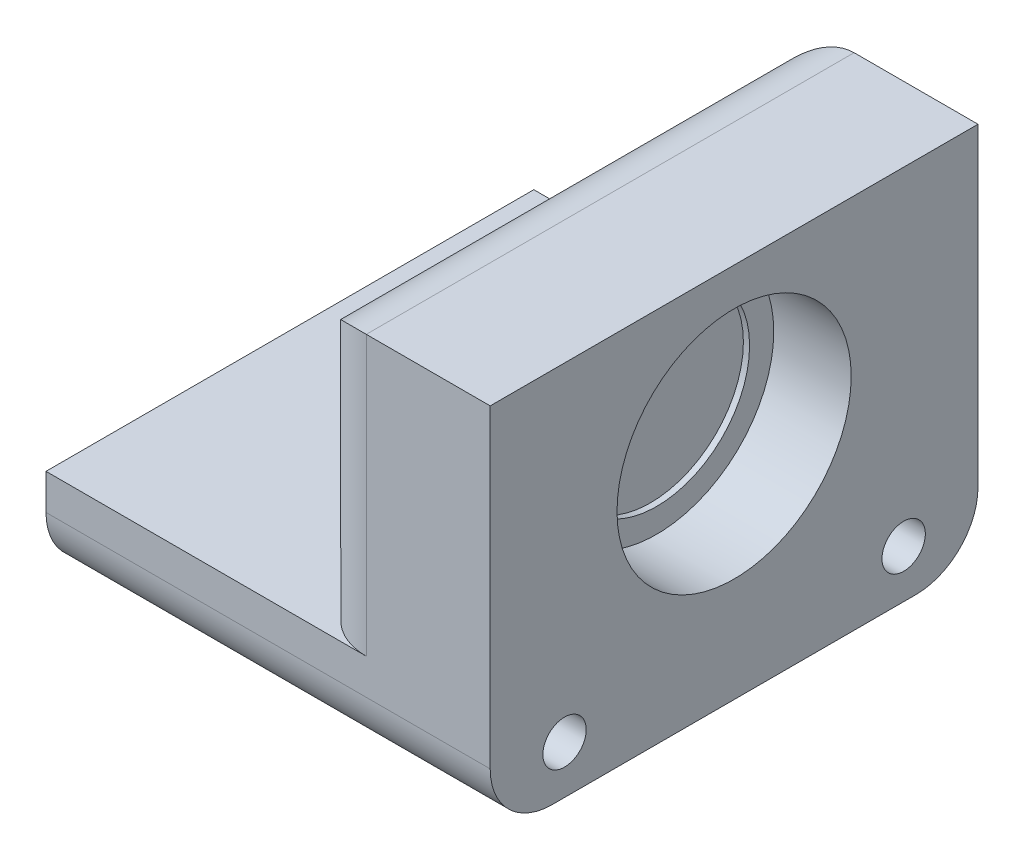
ISO-10303-21;
HEADER;
FILE_DESCRIPTION(('STEP AP214'),'2;1');
FILE_NAME('part.step','',(''),(''),'','','');
FILE_SCHEMA(('AUTOMOTIVE_DESIGN { 1 0 10303 214 1 1 1 1 }'));
ENDSEC;
DATA;
#1=APPLICATION_CONTEXT('core data for automotive mechanical design processes');
#2=APPLICATION_PROTOCOL_DEFINITION('international standard','automotive_design',2000,#1);
#3=PRODUCT_CONTEXT('',#1,'mechanical');
#4=PRODUCT('Part','Part','',(#3));
#5=PRODUCT_RELATED_PRODUCT_CATEGORY('part','',(#4));
#6=PRODUCT_DEFINITION_FORMATION('','',#4);
#7=PRODUCT_DEFINITION_CONTEXT('part definition',#1,'design');
#8=PRODUCT_DEFINITION('design','',#6,#7);
#9=PRODUCT_DEFINITION_SHAPE('','',#8);
#10=(LENGTH_UNIT() NAMED_UNIT(*) SI_UNIT(.MILLI.,.METRE.));
#11=(NAMED_UNIT(*) PLANE_ANGLE_UNIT() SI_UNIT($,.RADIAN.));
#12=(NAMED_UNIT(*) SI_UNIT($,.STERADIAN.) SOLID_ANGLE_UNIT());
#13=UNCERTAINTY_MEASURE_WITH_UNIT(LENGTH_MEASURE(1.E-05),#10,'distance_accuracy_value','');
#14=(GEOMETRIC_REPRESENTATION_CONTEXT(3) GLOBAL_UNCERTAINTY_ASSIGNED_CONTEXT((#13)) GLOBAL_UNIT_ASSIGNED_CONTEXT((#10,
#11,#12)) REPRESENTATION_CONTEXT('',''));
#15=CARTESIAN_POINT('',(0.,0.,0.));
#16=DIRECTION('',(0.,0.,1.));
#17=DIRECTION('',(1.,0.,0.));
#18=AXIS2_PLACEMENT_3D('',#15,#16,#17);
#19=CARTESIAN_POINT('',(-61.1504901312249,0.,-20.));
#20=DIRECTION('',(0.,1.,0.));
#21=DIRECTION('',(-1.,0.,0.));
#22=AXIS2_PLACEMENT_3D('',#19,#20,#21);
#23=PLANE('',#22);
#24=CARTESIAN_POINT('',(-64.492285063225,0.,-12.750000088));
#25=DIRECTION('',(0.,1.,0.));
#26=DIRECTION('',(-1.,0.,0.));
#27=AXIS2_PLACEMENT_3D('',#24,#25,#26);
#28=CIRCLE('',#27,1.26349999999999);
#29=CARTESIAN_POINT('',(-65.755785063225,0.,-12.750000088));
#30=VERTEX_POINT('',#29);
#31=EDGE_CURVE('E365',#30,#30,#28,.T.);
#32=ORIENTED_EDGE('',*,*,#31,.F.);
#33=EDGE_LOOP('',(#32));
#34=FACE_BOUND('',#33,.T.);
#35=CARTESIAN_POINT('',(-64.492285063225,0.,-7.249999912));
#36=DIRECTION('',(0.,1.,0.));
#37=DIRECTION('',(-1.,0.,0.));
#38=AXIS2_PLACEMENT_3D('',#35,#36,#37);
#39=CIRCLE('',#38,1.26349999999999);
#40=CARTESIAN_POINT('',(-65.755785063225,0.,-7.249999912));
#41=VERTEX_POINT('',#40);
#42=EDGE_CURVE('E261',#41,#41,#39,.T.);
#43=ORIENTED_EDGE('',*,*,#42,.F.);
#44=EDGE_LOOP('',(#43));
#45=FACE_BOUND('',#44,.T.);
#46=DIRECTION('',(-1.,0.,0.));
#47=VECTOR('',#46,1.);
#48=CARTESIAN_POINT('',(-61.1504901312249,0.,0.));
#49=LINE('',#48,#47);
#50=CARTESIAN_POINT('',(-58.6104901312249,0.,0.));
#51=VERTEX_POINT('',#50);
#52=CARTESIAN_POINT('',(-71.742285041225,0.,0.));
#53=VERTEX_POINT('',#52);
#54=EDGE_CURVE('E152',#51,#53,#49,.T.);
#55=ORIENTED_EDGE('',*,*,#54,.F.);
#56=CARTESIAN_POINT('',(-58.6104901312249,0.,-2.54));
#57=DIRECTION('',(0.,1.,0.));
#58=DIRECTION('',(-1.,0.,0.));
#59=AXIS2_PLACEMENT_3D('',#56,#57,#58);
#60=CIRCLE('',#59,2.54);
#61=CARTESIAN_POINT('',(-61.1504901312249,0.,-2.54));
#62=VERTEX_POINT('',#61);
#63=EDGE_CURVE('E11',#51,#62,#60,.F.);
#64=ORIENTED_EDGE('',*,*,#63,.T.);
#65=DIRECTION('',(0.,0.,1.));
#66=VECTOR('',#65,1.);
#67=CARTESIAN_POINT('',(-61.1504901312249,0.,-20.));
#68=LINE('',#67,#66);
#69=CARTESIAN_POINT('',(-61.1504901312249,0.,-17.46));
#70=VERTEX_POINT('',#69);
#71=EDGE_CURVE('E157',#70,#62,#68,.T.);
#72=ORIENTED_EDGE('',*,*,#71,.F.);
#73=CARTESIAN_POINT('',(-58.6104901312249,0.,-17.46));
#74=DIRECTION('',(0.,1.,0.));
#75=DIRECTION('',(-1.,0.,0.));
#76=AXIS2_PLACEMENT_3D('',#73,#74,#75);
#77=CIRCLE('',#76,2.54);
#78=CARTESIAN_POINT('',(-58.6104901312249,0.,-20.));
#79=VERTEX_POINT('',#78);
#80=EDGE_CURVE('E42',#70,#79,#77,.F.);
#81=ORIENTED_EDGE('',*,*,#80,.T.);
#82=DIRECTION('',(-1.,0.,0.));
#83=VECTOR('',#82,1.);
#84=CARTESIAN_POINT('',(-61.1504901312249,0.,-20.));
#85=LINE('',#84,#83);
#86=CARTESIAN_POINT('',(-71.742285041225,0.,-20.));
#87=VERTEX_POINT('',#86);
#88=EDGE_CURVE('E131',#79,#87,#85,.T.);
#89=ORIENTED_EDGE('',*,*,#88,.T.);
#90=DIRECTION('',(0.,0.,1.));
#91=VECTOR('',#90,1.);
#92=CARTESIAN_POINT('',(-71.742285041225,0.,-20.));
#93=LINE('',#92,#91);
#94=EDGE_CURVE('E117',#87,#53,#93,.T.);
#95=ORIENTED_EDGE('',*,*,#94,.T.);
#96=EDGE_LOOP('',(#55,#64,#72,#81,#89,#95));
#97=FACE_BOUND('',#96,.T.);
#98=ADVANCED_FACE('F33',(#34,#45,#97),#23,.T.);
#99=CARTESIAN_POINT('',(-61.1504901312249,11.43,-20.));
#100=DIRECTION('',(-1.,0.,0.));
#101=DIRECTION('',(0.,0.,1.));
#102=AXIS2_PLACEMENT_3D('',#99,#100,#101);
#103=PLANE('',#102);
#104=DIRECTION('',(0.,0.,1.));
#105=VECTOR('',#104,1.);
#106=CARTESIAN_POINT('',(-61.1504901312249,8.88999999999999,-20.));
#107=LINE('',#106,#105);
#108=CARTESIAN_POINT('',(-61.1504901312249,8.88999999999999,-12.9205582274627));
#109=VERTEX_POINT('',#108);
#110=CARTESIAN_POINT('',(-61.1504901312249,8.88999999999999,-17.46));
#111=VERTEX_POINT('',#110);
#112=EDGE_CURVE('E170',#109,#111,#107,.F.);
#113=ORIENTED_EDGE('',*,*,#112,.T.);
#114=DIRECTION('',(0.,-1.,0.));
#115=VECTOR('',#114,1.);
#116=CARTESIAN_POINT('',(-61.1504901312249,0.,-17.46));
#117=LINE('',#116,#115);
#118=EDGE_CURVE('E172',#111,#70,#117,.T.);
#119=ORIENTED_EDGE('',*,*,#118,.T.);
#120=ORIENTED_EDGE('',*,*,#71,.T.);
#121=DIRECTION('',(0.,-1.,0.));
#122=VECTOR('',#121,1.);
#123=CARTESIAN_POINT('',(-61.1504901312249,11.43,-2.54));
#124=LINE('',#123,#122);
#125=CARTESIAN_POINT('',(-61.1504901312249,8.88999999999999,-2.54));
#126=VERTEX_POINT('',#125);
#127=EDGE_CURVE('E160',#62,#126,#124,.F.);
#128=ORIENTED_EDGE('',*,*,#127,.T.);
#129=DIRECTION('',(0.,0.,1.));
#130=VECTOR('',#129,1.);
#131=CARTESIAN_POINT('',(-61.1504901312249,8.88999999999999,-20.));
#132=LINE('',#131,#130);
#133=CARTESIAN_POINT('',(-61.1504901312249,8.88999999999999,-7.07944177253729));
#134=VERTEX_POINT('',#133);
#135=EDGE_CURVE('E168',#126,#134,#132,.F.);
#136=ORIENTED_EDGE('',*,*,#135,.T.);
#137=CARTESIAN_POINT('',(-61.1504901312249,5.08,-10.));
#138=DIRECTION('',(-1.,0.,0.));
#139=DIRECTION('',(0.,0.,1.));
#140=AXIS2_PLACEMENT_3D('',#137,#138,#139);
#141=CIRCLE('',#140,4.8006);
#142=EDGE_CURVE('E299',#109,#134,#141,.T.);
#143=ORIENTED_EDGE('',*,*,#142,.F.);
#144=EDGE_LOOP('',(#113,#119,#120,#128,#136,#143));
#145=FACE_BOUND('',#144,.T.);
#146=ADVANCED_FACE('F223',(#145),#103,.T.);
#147=CARTESIAN_POINT('',(-53.530479711225,11.43,-20.));
#148=DIRECTION('',(0.,1.,0.));
#149=DIRECTION('',(0.,0.,1.));
#150=AXIS2_PLACEMENT_3D('',#147,#148,#149);
#151=PLANE('',#150);
#152=DIRECTION('',(-1.,0.,0.));
#153=VECTOR('',#152,1.);
#154=CARTESIAN_POINT('',(-53.530479711225,11.43,-20.));
#155=LINE('',#154,#153);
#156=CARTESIAN_POINT('',(-53.530479711225,11.43,-20.));
#157=VERTEX_POINT('',#156);
#158=CARTESIAN_POINT('',(-58.6104901312249,11.43,-20.));
#159=VERTEX_POINT('',#158);
#160=EDGE_CURVE('E127',#157,#159,#155,.T.);
#161=ORIENTED_EDGE('',*,*,#160,.T.);
#162=DIRECTION('',(0.,0.,1.));
#163=VECTOR('',#162,1.);
#164=CARTESIAN_POINT('',(-58.6104901312249,11.43,-20.));
#165=LINE('',#164,#163);
#166=CARTESIAN_POINT('',(-58.6104901312249,11.43,0.));
#167=VERTEX_POINT('',#166);
#168=EDGE_CURVE('E178',#159,#167,#165,.T.);
#169=ORIENTED_EDGE('',*,*,#168,.T.);
#170=DIRECTION('',(-1.,0.,0.));
#171=VECTOR('',#170,1.);
#172=CARTESIAN_POINT('',(-53.530479711225,11.43,0.));
#173=LINE('',#172,#171);
#174=CARTESIAN_POINT('',(-53.530479711225,11.43,0.));
#175=VERTEX_POINT('',#174);
#176=EDGE_CURVE('E140',#175,#167,#173,.T.);
#177=ORIENTED_EDGE('',*,*,#176,.F.);
#178=DIRECTION('',(0.,0.,1.));
#179=VECTOR('',#178,1.);
#180=CARTESIAN_POINT('',(-53.530479711225,11.43,-20.));
#181=LINE('',#180,#179);
#182=EDGE_CURVE('E161',#157,#175,#181,.T.);
#183=ORIENTED_EDGE('',*,*,#182,.F.);
#184=EDGE_LOOP('',(#161,#169,#177,#183));
#185=FACE_BOUND('',#184,.T.);
#186=ADVANCED_FACE('F226',(#185),#151,.T.);
#187=CARTESIAN_POINT('',(-53.530479711225,-4.00000000000001,-20.));
#188=DIRECTION('',(1.,0.,0.));
#189=DIRECTION('',(0.,0.,-1.));
#190=AXIS2_PLACEMENT_3D('',#187,#188,#189);
#191=PLANE('',#190);
#192=CARTESIAN_POINT('',(-53.530479711225,-2.03200000000001,-16.952));
#193=DIRECTION('',(-1.,0.,0.));
#194=DIRECTION('',(0.,0.,1.));
#195=AXIS2_PLACEMENT_3D('',#192,#193,#194);
#196=CIRCLE('',#195,0.888999999999995);
#197=CARTESIAN_POINT('',(-53.530479711225,-2.03200000000001,-16.063));
#198=VERTEX_POINT('',#197);
#199=EDGE_CURVE('E352',#198,#198,#196,.T.);
#200=ORIENTED_EDGE('',*,*,#199,.T.);
#201=EDGE_LOOP('',(#200));
#202=FACE_BOUND('',#201,.T.);
#203=CARTESIAN_POINT('',(-53.530479711225,-2.03200000000001,-3.048));
#204=DIRECTION('',(-1.,0.,0.));
#205=DIRECTION('',(0.,0.,1.));
#206=AXIS2_PLACEMENT_3D('',#203,#204,#205);
#207=CIRCLE('',#206,0.888999999999995);
#208=CARTESIAN_POINT('',(-53.530479711225,-2.03200000000001,-2.159));
#209=VERTEX_POINT('',#208);
#210=EDGE_CURVE('E338',#209,#209,#207,.T.);
#211=ORIENTED_EDGE('',*,*,#210,.T.);
#212=EDGE_LOOP('',(#211));
#213=FACE_BOUND('',#212,.T.);
#214=CARTESIAN_POINT('',(-53.530479711225,5.08,-10.));
#215=DIRECTION('',(1.,0.,0.));
#216=DIRECTION('',(0.,0.,-1.));
#217=AXIS2_PLACEMENT_3D('',#214,#215,#216);
#218=CIRCLE('',#217,4.8006);
#219=CARTESIAN_POINT('',(-53.530479711225,5.08,-14.8006));
#220=VERTEX_POINT('',#219);
#221=EDGE_CURVE('E329',#220,#220,#218,.T.);
#222=ORIENTED_EDGE('',*,*,#221,.F.);
#223=EDGE_LOOP('',(#222));
#224=FACE_BOUND('',#223,.T.);
#225=DIRECTION('',(0.,1.,0.));
#226=VECTOR('',#225,1.);
#227=CARTESIAN_POINT('',(-53.530479711225,-4.00000000000001,0.));
#228=LINE('',#227,#226);
#229=CARTESIAN_POINT('',(-53.530479711225,-1.46000000000001,0.));
#230=VERTEX_POINT('',#229);
#231=EDGE_CURVE('E143',#230,#175,#228,.T.);
#232=ORIENTED_EDGE('',*,*,#231,.F.);
#233=CARTESIAN_POINT('',(-53.530479711225,-1.46000000000001,-2.54));
#234=DIRECTION('',(1.,0.,0.));
#235=DIRECTION('',(0.,0.,-1.));
#236=AXIS2_PLACEMENT_3D('',#233,#234,#235);
#237=CIRCLE('',#236,2.54);
#238=CARTESIAN_POINT('',(-53.530479711225,-4.00000000000001,-2.54));
#239=VERTEX_POINT('',#238);
#240=EDGE_CURVE('E276',#230,#239,#237,.T.);
#241=ORIENTED_EDGE('',*,*,#240,.T.);
#242=DIRECTION('',(0.,0.,1.));
#243=VECTOR('',#242,1.);
#244=CARTESIAN_POINT('',(-53.530479711225,-4.00000000000001,-20.));
#245=LINE('',#244,#243);
#246=CARTESIAN_POINT('',(-53.530479711225,-4.00000000000001,-17.46));
#247=VERTEX_POINT('',#246);
#248=EDGE_CURVE('E164',#247,#239,#245,.T.);
#249=ORIENTED_EDGE('',*,*,#248,.F.);
#250=CARTESIAN_POINT('',(-53.530479711225,-1.46000000000001,-17.46));
#251=DIRECTION('',(1.,0.,0.));
#252=DIRECTION('',(0.,0.,-1.));
#253=AXIS2_PLACEMENT_3D('',#250,#251,#252);
#254=CIRCLE('',#253,2.54);
#255=CARTESIAN_POINT('',(-53.530479711225,-1.46000000000001,-20.));
#256=VERTEX_POINT('',#255);
#257=EDGE_CURVE('E278',#247,#256,#254,.T.);
#258=ORIENTED_EDGE('',*,*,#257,.T.);
#259=DIRECTION('',(0.,1.,0.));
#260=VECTOR('',#259,1.);
#261=CARTESIAN_POINT('',(-53.530479711225,-4.00000000000001,-20.));
#262=LINE('',#261,#260);
#263=EDGE_CURVE('E136',#256,#157,#262,.T.);
#264=ORIENTED_EDGE('',*,*,#263,.T.);
#265=ORIENTED_EDGE('',*,*,#182,.T.);
#266=EDGE_LOOP('',(#232,#241,#249,#258,#264,#265));
#267=FACE_BOUND('',#266,.T.);
#268=ADVANCED_FACE('F230',(#202,#213,#224,#267),#191,.T.);
#269=CARTESIAN_POINT('',(-71.742285041225,-4.00000000000001,-20.));
#270=DIRECTION('',(0.,-1.,0.));
#271=DIRECTION('',(1.,0.,0.));
#272=AXIS2_PLACEMENT_3D('',#269,#270,#271);
#273=PLANE('',#272);
#274=CARTESIAN_POINT('',(-64.492285063225,-4.00000000000001,-12.750000088));
#275=DIRECTION('',(0.,-1.,0.));
#276=DIRECTION('',(-1.,0.,0.));
#277=AXIS2_PLACEMENT_3D('',#274,#275,#276);
#278=CIRCLE('',#277,1.26349999999999);
#279=CARTESIAN_POINT('',(-65.755785063225,-4.00000000000001,-12.750000088));
#280=VERTEX_POINT('',#279);
#281=EDGE_CURVE('E368',#280,#280,#278,.T.);
#282=ORIENTED_EDGE('',*,*,#281,.F.);
#283=EDGE_LOOP('',(#282));
#284=FACE_BOUND('',#283,.T.);
#285=CARTESIAN_POINT('',(-64.492285063225,-4.00000000000001,-7.249999912));
#286=DIRECTION('',(0.,-1.,0.));
#287=DIRECTION('',(1.,0.,0.));
#288=AXIS2_PLACEMENT_3D('',#285,#286,#287);
#289=CIRCLE('',#288,1.26349999999999);
#290=CARTESIAN_POINT('',(-63.228785063225,-4.00000000000001,-7.249999912));
#291=VERTEX_POINT('',#290);
#292=EDGE_CURVE('E265',#291,#291,#289,.T.);
#293=ORIENTED_EDGE('',*,*,#292,.F.);
#294=EDGE_LOOP('',(#293));
#295=FACE_BOUND('',#294,.T.);
#296=ORIENTED_EDGE('',*,*,#248,.T.);
#297=DIRECTION('',(1.,0.,0.));
#298=VECTOR('',#297,1.);
#299=CARTESIAN_POINT('',(-71.742285041225,-4.00000000000001,-2.54));
#300=LINE('',#299,#298);
#301=CARTESIAN_POINT('',(-71.742285041225,-4.00000000000001,-2.54));
#302=VERTEX_POINT('',#301);
#303=EDGE_CURVE('E50',#239,#302,#300,.F.);
#304=ORIENTED_EDGE('',*,*,#303,.T.);
#305=DIRECTION('',(0.,0.,1.));
#306=VECTOR('',#305,1.);
#307=CARTESIAN_POINT('',(-71.742285041225,-4.00000000000001,-20.));
#308=LINE('',#307,#306);
#309=CARTESIAN_POINT('',(-71.742285041225,-4.00000000000001,-17.46));
#310=VERTEX_POINT('',#309);
#311=EDGE_CURVE('E126',#310,#302,#308,.T.);
#312=ORIENTED_EDGE('',*,*,#311,.F.);
#313=DIRECTION('',(1.,0.,0.));
#314=VECTOR('',#313,1.);
#315=CARTESIAN_POINT('',(-53.530479711225,-4.00000000000001,-17.46));
#316=LINE('',#315,#314);
#317=EDGE_CURVE('E273',#310,#247,#316,.T.);
#318=ORIENTED_EDGE('',*,*,#317,.T.);
#319=EDGE_LOOP('',(#296,#304,#312,#318));
#320=FACE_BOUND('',#319,.T.);
#321=ADVANCED_FACE('F234',(#284,#295,#320),#273,.T.);
#322=CARTESIAN_POINT('',(-71.742285041225,0.,-20.));
#323=DIRECTION('',(-1.,0.,0.));
#324=DIRECTION('',(0.,0.,1.));
#325=AXIS2_PLACEMENT_3D('',#322,#323,#324);
#326=PLANE('',#325);
#327=CARTESIAN_POINT('',(-71.742285041225,-2.03200000000001,-16.952));
#328=DIRECTION('',(-1.,0.,0.));
#329=DIRECTION('',(0.,0.,1.));
#330=AXIS2_PLACEMENT_3D('',#327,#328,#329);
#331=CIRCLE('',#330,1.5875);
#332=CARTESIAN_POINT('',(-71.742285041225,-2.03200000000001,-15.3645));
#333=VERTEX_POINT('',#332);
#334=EDGE_CURVE('E263',#333,#333,#331,.T.);
#335=ORIENTED_EDGE('',*,*,#334,.F.);
#336=EDGE_LOOP('',(#335));
#337=FACE_BOUND('',#336,.T.);
#338=CARTESIAN_POINT('',(-71.742285041225,-2.03200000000001,-3.048));
#339=DIRECTION('',(-1.,0.,0.));
#340=DIRECTION('',(0.,0.,1.));
#341=AXIS2_PLACEMENT_3D('',#338,#339,#340);
#342=CIRCLE('',#341,1.5875);
#343=CARTESIAN_POINT('',(-71.742285041225,-2.03200000000001,-1.4605));
#344=VERTEX_POINT('',#343);
#345=EDGE_CURVE('E349',#344,#344,#342,.T.);
#346=ORIENTED_EDGE('',*,*,#345,.F.);
#347=EDGE_LOOP('',(#346));
#348=FACE_BOUND('',#347,.T.);
#349=CARTESIAN_POINT('',(-71.742285041225,-2.00000000000001,-7.714));
#350=DIRECTION('',(-1.,0.,0.));
#351=DIRECTION('',(0.,0.,-1.));
#352=AXIS2_PLACEMENT_3D('',#349,#350,#351);
#353=CIRCLE('',#352,1.27);
#354=CARTESIAN_POINT('',(-71.742285041225,-2.00000000000001,-8.984));
#355=VERTEX_POINT('',#354);
#356=EDGE_CURVE('E305',#355,#355,#353,.T.);
#357=ORIENTED_EDGE('',*,*,#356,.F.);
#358=EDGE_LOOP('',(#357));
#359=FACE_BOUND('',#358,.T.);
#360=CARTESIAN_POINT('',(-71.742285041225,-2.00000000000001,-12.286));
#361=DIRECTION('',(-1.,0.,0.));
#362=DIRECTION('',(0.,0.,1.));
#363=AXIS2_PLACEMENT_3D('',#360,#361,#362);
#364=CIRCLE('',#363,1.27);
#365=CARTESIAN_POINT('',(-71.742285041225,-2.00000000000001,-11.016));
#366=VERTEX_POINT('',#365);
#367=EDGE_CURVE('E146',#366,#366,#364,.T.);
#368=ORIENTED_EDGE('',*,*,#367,.F.);
#369=EDGE_LOOP('',(#368));
#370=FACE_BOUND('',#369,.T.);
#371=ORIENTED_EDGE('',*,*,#311,.T.);
#372=CARTESIAN_POINT('',(-71.742285041225,-1.46000000000001,-2.54));
#373=DIRECTION('',(-1.,0.,0.));
#374=DIRECTION('',(0.,0.,1.));
#375=AXIS2_PLACEMENT_3D('',#372,#373,#374);
#376=CIRCLE('',#375,2.54);
#377=CARTESIAN_POINT('',(-71.742285041225,-1.46000000000001,0.));
#378=VERTEX_POINT('',#377);
#379=EDGE_CURVE('E269',#302,#378,#376,.T.);
#380=ORIENTED_EDGE('',*,*,#379,.T.);
#381=DIRECTION('',(0.,-1.,0.));
#382=VECTOR('',#381,1.);
#383=CARTESIAN_POINT('',(-71.742285041225,0.,0.));
#384=LINE('',#383,#382);
#385=EDGE_CURVE('E122',#53,#378,#384,.T.);
#386=ORIENTED_EDGE('',*,*,#385,.F.);
#387=ORIENTED_EDGE('',*,*,#94,.F.);
#388=DIRECTION('',(0.,-1.,0.));
#389=VECTOR('',#388,1.);
#390=CARTESIAN_POINT('',(-71.742285041225,0.,-20.));
#391=LINE('',#390,#389);
#392=CARTESIAN_POINT('',(-71.742285041225,-1.46000000000001,-20.));
#393=VERTEX_POINT('',#392);
#394=EDGE_CURVE('E120',#87,#393,#391,.T.);
#395=ORIENTED_EDGE('',*,*,#394,.T.);
#396=CARTESIAN_POINT('',(-71.742285041225,-1.46000000000001,-17.46));
#397=DIRECTION('',(-1.,0.,0.));
#398=DIRECTION('',(0.,0.,1.));
#399=AXIS2_PLACEMENT_3D('',#396,#397,#398);
#400=CIRCLE('',#399,2.54);
#401=EDGE_CURVE('E57',#393,#310,#400,.T.);
#402=ORIENTED_EDGE('',*,*,#401,.T.);
#403=EDGE_LOOP('',(#371,#380,#386,#387,#395,#402));
#404=FACE_BOUND('',#403,.T.);
#405=ADVANCED_FACE('F119',(#337,#348,#359,#370,#404),#326,.T.);
#406=CARTESIAN_POINT('',(0.,0.,-20.));
#407=DIRECTION('',(0.,0.,1.));
#408=DIRECTION('',(1.,0.,0.));
#409=AXIS2_PLACEMENT_3D('',#406,#407,#408);
#410=PLANE('',#409);
#411=ORIENTED_EDGE('',*,*,#88,.F.);
#412=DIRECTION('',(0.,-1.,0.));
#413=VECTOR('',#412,1.);
#414=CARTESIAN_POINT('',(-58.6104901312249,11.43,-20.));
#415=LINE('',#414,#413);
#416=EDGE_CURVE('E176',#79,#159,#415,.F.);
#417=ORIENTED_EDGE('',*,*,#416,.T.);
#418=ORIENTED_EDGE('',*,*,#160,.F.);
#419=ORIENTED_EDGE('',*,*,#263,.F.);
#420=DIRECTION('',(1.,0.,0.));
#421=VECTOR('',#420,1.);
#422=CARTESIAN_POINT('',(-71.742285041225,-1.46000000000001,-20.));
#423=LINE('',#422,#421);
#424=EDGE_CURVE('E135',#256,#393,#423,.F.);
#425=ORIENTED_EDGE('',*,*,#424,.T.);
#426=ORIENTED_EDGE('',*,*,#394,.F.);
#427=EDGE_LOOP('',(#411,#417,#418,#419,#425,#426));
#428=FACE_BOUND('',#427,.T.);
#429=ADVANCED_FACE('F130',(#428),#410,.F.);
#430=CARTESIAN_POINT('',(0.,0.,0.));
#431=DIRECTION('',(0.,0.,1.));
#432=DIRECTION('',(1.,0.,0.));
#433=AXIS2_PLACEMENT_3D('',#430,#431,#432);
#434=PLANE('',#433);
#435=ORIENTED_EDGE('',*,*,#176,.T.);
#436=DIRECTION('',(0.,-1.,0.));
#437=VECTOR('',#436,1.);
#438=CARTESIAN_POINT('',(-58.6104901312249,0.,0.));
#439=LINE('',#438,#437);
#440=EDGE_CURVE('E279',#167,#51,#439,.T.);
#441=ORIENTED_EDGE('',*,*,#440,.T.);
#442=ORIENTED_EDGE('',*,*,#54,.T.);
#443=ORIENTED_EDGE('',*,*,#385,.T.);
#444=DIRECTION('',(1.,0.,0.));
#445=VECTOR('',#444,1.);
#446=CARTESIAN_POINT('',(0.,-1.46000000000001,0.));
#447=LINE('',#446,#445);
#448=EDGE_CURVE('E187',#378,#230,#447,.T.);
#449=ORIENTED_EDGE('',*,*,#448,.T.);
#450=ORIENTED_EDGE('',*,*,#231,.T.);
#451=EDGE_LOOP('',(#435,#441,#442,#443,#449,#450));
#452=FACE_BOUND('',#451,.T.);
#453=ADVANCED_FACE('F216',(#452),#434,.T.);
#454=CARTESIAN_POINT('',(-67.7422849132249,-2.00000000000001,-12.286));
#455=DIRECTION('',(-1.,0.,0.));
#456=DIRECTION('',(0.,0.,1.));
#457=AXIS2_PLACEMENT_3D('',#454,#455,#456);
#458=CYLINDRICAL_SURFACE('',#457,1.27);
#459=CARTESIAN_POINT('',(-67.7422849132249,-2.00000000000001,-12.286));
#460=DIRECTION('',(-1.,0.,0.));
#461=DIRECTION('',(0.,0.,1.));
#462=AXIS2_PLACEMENT_3D('',#459,#460,#461);
#463=CIRCLE('',#462,1.27);
#464=CARTESIAN_POINT('',(-67.7422849132249,-2.00000000000001,-11.016));
#465=VERTEX_POINT('',#464);
#466=EDGE_CURVE('E154',#465,#465,#463,.T.);
#467=ORIENTED_EDGE('',*,*,#466,.F.);
#468=EDGE_LOOP('',(#467));
#469=FACE_BOUND('',#468,.T.);
#470=ORIENTED_EDGE('',*,*,#367,.T.);
#471=EDGE_LOOP('',(#470));
#472=FACE_BOUND('',#471,.T.);
#473=ADVANCED_FACE('F212',(#469,#472),#458,.F.);
#474=CARTESIAN_POINT('',(-67.7422849132249,-2.00000000000001,-12.286));
#475=DIRECTION('',(-1.,0.,0.));
#476=DIRECTION('',(0.,0.,1.));
#477=AXIS2_PLACEMENT_3D('',#474,#475,#476);
#478=PLANE('',#477);
#479=ORIENTED_EDGE('',*,*,#466,.T.);
#480=EDGE_LOOP('',(#479));
#481=FACE_BOUND('',#480,.T.);
#482=ADVANCED_FACE('F208',(#481),#478,.T.);
#483=CARTESIAN_POINT('',(-67.7422849132249,-2.00000000000001,-7.714));
#484=DIRECTION('',(-1.,0.,0.));
#485=DIRECTION('',(0.,0.,1.));
#486=AXIS2_PLACEMENT_3D('',#483,#484,#485);
#487=CYLINDRICAL_SURFACE('',#486,1.27);
#488=CARTESIAN_POINT('',(-67.7422849132249,-2.00000000000001,-7.714));
#489=DIRECTION('',(-1.,0.,0.));
#490=DIRECTION('',(0.,0.,-1.));
#491=AXIS2_PLACEMENT_3D('',#488,#489,#490);
#492=CIRCLE('',#491,1.27);
#493=CARTESIAN_POINT('',(-67.7422849132249,-2.00000000000001,-8.984));
#494=VERTEX_POINT('',#493);
#495=EDGE_CURVE('E312',#494,#494,#492,.T.);
#496=ORIENTED_EDGE('',*,*,#495,.F.);
#497=EDGE_LOOP('',(#496));
#498=FACE_BOUND('',#497,.T.);
#499=ORIENTED_EDGE('',*,*,#356,.T.);
#500=EDGE_LOOP('',(#499));
#501=FACE_BOUND('',#500,.T.);
#502=ADVANCED_FACE('F204',(#498,#501),#487,.F.);
#503=CARTESIAN_POINT('',(-67.7422849132249,-2.00000000000001,-7.714));
#504=DIRECTION('',(1.,0.,0.));
#505=DIRECTION('',(0.,0.,-1.));
#506=AXIS2_PLACEMENT_3D('',#503,#504,#505);
#507=PLANE('',#506);
#508=ORIENTED_EDGE('',*,*,#495,.T.);
#509=EDGE_LOOP('',(#508));
#510=FACE_BOUND('',#509,.T.);
#511=ADVANCED_FACE('F199',(#510),#507,.F.);
#512=CARTESIAN_POINT('',(-57.975490131225,5.08,-10.));
#513=DIRECTION('',(-1.,0.,0.));
#514=DIRECTION('',(0.,0.,1.));
#515=AXIS2_PLACEMENT_3D('',#512,#513,#514);
#516=CYLINDRICAL_SURFACE('',#515,4.8006);
#517=CARTESIAN_POINT('',(-57.975490131225,5.08,-10.));
#518=DIRECTION('',(-1.,0.,0.));
#519=DIRECTION('',(0.,0.,1.));
#520=AXIS2_PLACEMENT_3D('',#517,#518,#519);
#521=CIRCLE('',#520,4.8006);
#522=CARTESIAN_POINT('',(-57.975490131225,5.08,-5.1994));
#523=VERTEX_POINT('',#522);
#524=EDGE_CURVE('E301',#523,#523,#521,.T.);
#525=ORIENTED_EDGE('',*,*,#524,.F.);
#526=EDGE_LOOP('',(#525));
#527=FACE_BOUND('',#526,.T.);
#528=ORIENTED_EDGE('',*,*,#142,.T.);
#529=CARTESIAN_POINT('',(-61.1504901312249,8.88999999999999,-7.07944177253729));
#530=CARTESIAN_POINT('',(-61.1504752178332,8.95533055933466,-7.16465486263751));
#531=CARTESIAN_POINT('',(-61.147970500377,9.01775733054552,-7.25202763229909));
#532=CARTESIAN_POINT('',(-61.1392049280559,9.13649727920082,-7.43055431752008));
#533=CARTESIAN_POINT('',(-61.1329472655497,9.19281560463351,-7.52170495824394));
#534=CARTESIAN_POINT('',(-61.1178835876985,9.29922584653965,-7.70753758104752));
#535=CARTESIAN_POINT('',(-61.1090736875137,9.34930810348533,-7.80222475335888));
#536=CARTESIAN_POINT('',(-61.0900224610862,9.44299729773194,-7.99464011903791));
#537=CARTESIAN_POINT('',(-61.0797806876902,9.48660220344173,-8.09236925492731));
#538=CARTESIAN_POINT('',(-61.0570603395345,9.57432250350141,-8.30805579340597));
#539=CARTESIAN_POINT('',(-61.0445070869639,9.61715816825431,-8.42652800017256));
#540=CARTESIAN_POINT('',(-61.0204130495658,9.69341247685897,-8.66656671948753));
#541=CARTESIAN_POINT('',(-61.0088722751112,9.72683102423846,-8.78813326372149));
#542=CARTESIAN_POINT('',(-60.9881537090481,9.78400324273012,-9.03357842216891));
#543=CARTESIAN_POINT('',(-60.9789732320758,9.80776791529657,-9.15745423536281));
#544=CARTESIAN_POINT('',(-60.9640090983754,9.84549033497826,-9.40689635281039));
#545=CARTESIAN_POINT('',(-60.9582253565159,9.85944832787701,-9.53246261461617));
#546=CARTESIAN_POINT('',(-60.95054200197,9.87785920164709,-9.7905886396795));
#547=CARTESIAN_POINT('',(-60.9488458135577,9.88181473609463,-9.92319053286943));
#548=CARTESIAN_POINT('',(-60.950147791181,9.87873851556006,-10.188248698755));
#549=CARTESIAN_POINT('',(-60.9531462335266,9.87170611386549,-10.3207049624201));
#550=CARTESIAN_POINT('',(-60.9634627026244,9.84671369411663,-10.5846415326543));
#551=CARTESIAN_POINT('',(-60.9707883539776,9.82873438573997,-10.716119700719));
#552=CARTESIAN_POINT('',(-60.9888357039458,9.7820181873966,-10.9769004531179));
#553=CARTESIAN_POINT('',(-60.9995573154503,9.75328157336463,-11.1062030931676));
#554=CARTESIAN_POINT('',(-61.0225436926895,9.68673113912334,-11.3564045625824));
#555=CARTESIAN_POINT('',(-61.0347240290275,9.64935256149428,-11.4774275443442));
#556=CARTESIAN_POINT('',(-61.0595040038973,9.56517041506422,-11.716105782091));
#557=CARTESIAN_POINT('',(-61.0721036392206,9.51836691837115,-11.8337610638336));
#558=CARTESIAN_POINT('',(-61.0960509733243,9.41569806505787,-12.0648060067641));
#559=CARTESIAN_POINT('',(-61.1074018859541,9.35985693086788,-12.1782060985767));
#560=CARTESIAN_POINT('',(-61.1270980504909,9.23930146843172,-12.4004014378086));
#561=CARTESIAN_POINT('',(-61.1354453321816,9.17459317339159,-12.5091997509619));
#562=CARTESIAN_POINT('',(-61.1442106625589,9.07170971053745,-12.6675633948192));
#563=CARTESIAN_POINT('',(-61.1465026036923,9.03675637278427,-12.719139827191));
#564=CARTESIAN_POINT('',(-61.1496413594641,8.96485909008879,-12.82090605461));
#565=CARTESIAN_POINT('',(-61.1504886217203,8.92791576538303,-12.8710962744163));
#566=CARTESIAN_POINT('',(-61.1504901312249,8.88999999999999,-12.9205582274627));
#567=B_SPLINE_CURVE_WITH_KNOTS('',3,(#529,#530,#531,#532,#533,#534,#535,#536,#537,#538,#539,
#540,#541,#542,#543,#544,#545,#546,#547,#548,#549,#550,#551,#552,#553,#554,#555,#556,#557,#558,
#559,#560,#561,#562,#563,#564,#565,#566),.UNSPECIFIED.,.F.,.F.,(4,2,2,2,2,2,2,2,2,2,2,2,2,2,2,2,
2,2,4),(0.,0.321960568256824,0.643647655628667,0.965826988920784,1.28810715986738,
1.66751696424481,2.04693065528975,2.42591074928112,2.80488134460572,3.20235466108616,
3.59985137237208,3.99805057633738,4.39623956682874,4.77759005483418,5.15893762532421,
5.53927954765867,5.91936395895913,6.10634826304371,6.29327462157247),.UNSPECIFIED.);
#568=EDGE_CURVE('E180',#134,#109,#567,.T.);
#569=ORIENTED_EDGE('',*,*,#568,.T.);
#570=EDGE_LOOP('',(#528,#569));
#571=FACE_BOUND('',#570,.T.);
#572=ADVANCED_FACE('F193',(#527,#571),#516,.F.);
#573=CARTESIAN_POINT('',(-57.975490131225,5.08,-10.));
#574=DIRECTION('',(-1.,0.,0.));
#575=DIRECTION('',(0.,0.,1.));
#576=AXIS2_PLACEMENT_3D('',#573,#574,#575);
#577=PLANE('',#576);
#578=CARTESIAN_POINT('',(-57.975490131225,5.08,-10.));
#579=DIRECTION('',(-1.,0.,0.));
#580=DIRECTION('',(0.,0.,1.));
#581=AXIS2_PLACEMENT_3D('',#578,#579,#580);
#582=CIRCLE('',#581,3.81);
#583=CARTESIAN_POINT('',(-57.975490131225,5.08,-6.19));
#584=VERTEX_POINT('',#583);
#585=EDGE_CURVE('E308',#584,#584,#582,.T.);
#586=ORIENTED_EDGE('',*,*,#585,.F.);
#587=EDGE_LOOP('',(#586));
#588=FACE_BOUND('',#587,.T.);
#589=ORIENTED_EDGE('',*,*,#524,.T.);
#590=EDGE_LOOP('',(#589));
#591=FACE_BOUND('',#590,.T.);
#592=ADVANCED_FACE('F198',(#588,#591),#577,.T.);
#593=CARTESIAN_POINT('',(-57.721490131225,5.08,-10.));
#594=DIRECTION('',(-1.,0.,0.));
#595=DIRECTION('',(0.,0.,1.));
#596=AXIS2_PLACEMENT_3D('',#593,#594,#595);
#597=CYLINDRICAL_SURFACE('',#596,3.81);
#598=CARTESIAN_POINT('',(-57.721490131225,5.08,-10.));
#599=DIRECTION('',(-1.,0.,0.));
#600=DIRECTION('',(0.,0.,1.));
#601=AXIS2_PLACEMENT_3D('',#598,#599,#600);
#602=CIRCLE('',#601,3.81);
#603=CARTESIAN_POINT('',(-57.721490131225,5.08,-6.19));
#604=VERTEX_POINT('',#603);
#605=EDGE_CURVE('E302',#604,#604,#602,.T.);
#606=ORIENTED_EDGE('',*,*,#605,.F.);
#607=EDGE_LOOP('',(#606));
#608=FACE_BOUND('',#607,.T.);
#609=ORIENTED_EDGE('',*,*,#585,.T.);
#610=EDGE_LOOP('',(#609));
#611=FACE_BOUND('',#610,.T.);
#612=ADVANCED_FACE('F433',(#608,#611),#597,.F.);
#613=CARTESIAN_POINT('',(-57.721490131225,5.08,-10.));
#614=DIRECTION('',(-1.,0.,0.));
#615=DIRECTION('',(0.,0.,1.));
#616=AXIS2_PLACEMENT_3D('',#613,#614,#615);
#617=PLANE('',#616);
#618=ORIENTED_EDGE('',*,*,#605,.T.);
#619=EDGE_LOOP('',(#618));
#620=FACE_BOUND('',#619,.T.);
#621=ADVANCED_FACE('F430',(#620),#617,.T.);
#622=CARTESIAN_POINT('',(-56.705479711225,5.08,-10.));
#623=DIRECTION('',(1.,0.,0.));
#624=DIRECTION('',(0.,0.,-1.));
#625=AXIS2_PLACEMENT_3D('',#622,#623,#624);
#626=CYLINDRICAL_SURFACE('',#625,4.8006);
#627=CARTESIAN_POINT('',(-56.705479711225,5.08,-10.));
#628=DIRECTION('',(1.,0.,0.));
#629=DIRECTION('',(0.,0.,-1.));
#630=AXIS2_PLACEMENT_3D('',#627,#628,#629);
#631=CIRCLE('',#630,4.8006);
#632=CARTESIAN_POINT('',(-56.705479711225,5.08,-14.8006));
#633=VERTEX_POINT('',#632);
#634=EDGE_CURVE('E327',#633,#633,#631,.T.);
#635=ORIENTED_EDGE('',*,*,#634,.F.);
#636=EDGE_LOOP('',(#635));
#637=FACE_BOUND('',#636,.T.);
#638=ORIENTED_EDGE('',*,*,#221,.T.);
#639=EDGE_LOOP('',(#638));
#640=FACE_BOUND('',#639,.T.);
#641=ADVANCED_FACE('F426',(#637,#640),#626,.F.);
#642=CARTESIAN_POINT('',(-56.705479711225,5.08,-10.));
#643=DIRECTION('',(1.,0.,0.));
#644=DIRECTION('',(0.,0.,-1.));
#645=AXIS2_PLACEMENT_3D('',#642,#643,#644);
#646=PLANE('',#645);
#647=CARTESIAN_POINT('',(-56.705479711225,5.08,-10.));
#648=DIRECTION('',(1.,0.,0.));
#649=DIRECTION('',(0.,0.,-1.));
#650=AXIS2_PLACEMENT_3D('',#647,#648,#649);
#651=CIRCLE('',#650,3.81);
#652=CARTESIAN_POINT('',(-56.705479711225,5.08,-13.81));
#653=VERTEX_POINT('',#652);
#654=EDGE_CURVE('E335',#653,#653,#651,.T.);
#655=ORIENTED_EDGE('',*,*,#654,.F.);
#656=EDGE_LOOP('',(#655));
#657=FACE_BOUND('',#656,.T.);
#658=ORIENTED_EDGE('',*,*,#634,.T.);
#659=EDGE_LOOP('',(#658));
#660=FACE_BOUND('',#659,.T.);
#661=ADVANCED_FACE('F422',(#657,#660),#646,.T.);
#662=CARTESIAN_POINT('',(-56.959479711225,5.08,-10.));
#663=DIRECTION('',(1.,0.,0.));
#664=DIRECTION('',(0.,0.,-1.));
#665=AXIS2_PLACEMENT_3D('',#662,#663,#664);
#666=CYLINDRICAL_SURFACE('',#665,3.81);
#667=CARTESIAN_POINT('',(-56.959479711225,5.08,-10.));
#668=DIRECTION('',(1.,0.,0.));
#669=DIRECTION('',(0.,0.,-1.));
#670=AXIS2_PLACEMENT_3D('',#667,#668,#669);
#671=CIRCLE('',#670,3.81);
#672=CARTESIAN_POINT('',(-56.959479711225,5.08,-13.81));
#673=VERTEX_POINT('',#672);
#674=EDGE_CURVE('E332',#673,#673,#671,.T.);
#675=ORIENTED_EDGE('',*,*,#674,.F.);
#676=EDGE_LOOP('',(#675));
#677=FACE_BOUND('',#676,.T.);
#678=ORIENTED_EDGE('',*,*,#654,.T.);
#679=EDGE_LOOP('',(#678));
#680=FACE_BOUND('',#679,.T.);
#681=ADVANCED_FACE('F418',(#677,#680),#666,.F.);
#682=CARTESIAN_POINT('',(-56.959479711225,5.08,-10.));
#683=DIRECTION('',(1.,0.,0.));
#684=DIRECTION('',(0.,0.,-1.));
#685=AXIS2_PLACEMENT_3D('',#682,#683,#684);
#686=PLANE('',#685);
#687=ORIENTED_EDGE('',*,*,#674,.T.);
#688=EDGE_LOOP('',(#687));
#689=FACE_BOUND('',#688,.T.);
#690=ADVANCED_FACE('F414',(#689),#686,.T.);
#691=CARTESIAN_POINT('',(-71.742285041225,-2.03200000000001,-3.048));
#692=DIRECTION('',(-1.,0.,0.));
#693=DIRECTION('',(0.,0.,1.));
#694=AXIS2_PLACEMENT_3D('',#691,#692,#693);
#695=CYLINDRICAL_SURFACE('',#694,0.888999999999996);
#696=ORIENTED_EDGE('',*,*,#210,.F.);
#697=EDGE_LOOP('',(#696));
#698=FACE_BOUND('',#697,.T.);
#699=CARTESIAN_POINT('',(-57.010285041225,-2.03200000000001,-3.048));
#700=DIRECTION('',(-1.,0.,0.));
#701=DIRECTION('',(0.,0.,1.));
#702=AXIS2_PLACEMENT_3D('',#699,#700,#701);
#703=CIRCLE('',#702,0.888999999999997);
#704=CARTESIAN_POINT('',(-57.010285041225,-2.03200000000001,-2.159));
#705=VERTEX_POINT('',#704);
#706=EDGE_CURVE('E343',#705,#705,#703,.T.);
#707=ORIENTED_EDGE('',*,*,#706,.T.);
#708=EDGE_LOOP('',(#707));
#709=FACE_BOUND('',#708,.T.);
#710=ADVANCED_FACE('F410',(#698,#709),#695,.F.);
#711=CARTESIAN_POINT('',(-57.010285041225,-1.14300000000001,-3.048));
#712=DIRECTION('',(1.,0.,0.));
#713=DIRECTION('',(0.,0.,-1.));
#714=AXIS2_PLACEMENT_3D('',#711,#712,#713);
#715=PLANE('',#714);
#716=ORIENTED_EDGE('',*,*,#706,.F.);
#717=EDGE_LOOP('',(#716));
#718=FACE_BOUND('',#717,.T.);
#719=CARTESIAN_POINT('',(-57.010285041225,-2.03200000000001,-3.048));
#720=DIRECTION('',(-1.,0.,0.));
#721=DIRECTION('',(0.,0.,1.));
#722=AXIS2_PLACEMENT_3D('',#719,#720,#721);
#723=CIRCLE('',#722,1.5875);
#724=CARTESIAN_POINT('',(-57.010285041225,-2.03200000000001,-1.4605));
#725=VERTEX_POINT('',#724);
#726=EDGE_CURVE('E346',#725,#725,#723,.T.);
#727=ORIENTED_EDGE('',*,*,#726,.T.);
#728=EDGE_LOOP('',(#727));
#729=FACE_BOUND('',#728,.T.);
#730=ADVANCED_FACE('F406',(#718,#729),#715,.F.);
#731=CARTESIAN_POINT('',(-71.742285041225,-2.03200000000001,-3.048));
#732=DIRECTION('',(-1.,0.,0.));
#733=DIRECTION('',(0.,0.,1.));
#734=AXIS2_PLACEMENT_3D('',#731,#732,#733);
#735=CYLINDRICAL_SURFACE('',#734,1.5875);
#736=ORIENTED_EDGE('',*,*,#726,.F.);
#737=EDGE_LOOP('',(#736));
#738=FACE_BOUND('',#737,.T.);
#739=ORIENTED_EDGE('',*,*,#345,.T.);
#740=EDGE_LOOP('',(#739));
#741=FACE_BOUND('',#740,.T.);
#742=ADVANCED_FACE('F402',(#738,#741),#735,.F.);
#743=CARTESIAN_POINT('',(-71.742285041225,-2.03200000000001,-16.952));
#744=DIRECTION('',(-1.,0.,0.));
#745=DIRECTION('',(0.,0.,1.));
#746=AXIS2_PLACEMENT_3D('',#743,#744,#745);
#747=CYLINDRICAL_SURFACE('',#746,0.888999999999996);
#748=ORIENTED_EDGE('',*,*,#199,.F.);
#749=EDGE_LOOP('',(#748));
#750=FACE_BOUND('',#749,.T.);
#751=CARTESIAN_POINT('',(-57.010285041225,-2.03200000000001,-16.952));
#752=DIRECTION('',(-1.,0.,0.));
#753=DIRECTION('',(0.,0.,1.));
#754=AXIS2_PLACEMENT_3D('',#751,#752,#753);
#755=CIRCLE('',#754,0.888999999999997);
#756=CARTESIAN_POINT('',(-57.010285041225,-2.03200000000001,-16.063));
#757=VERTEX_POINT('',#756);
#758=EDGE_CURVE('E355',#757,#757,#755,.T.);
#759=ORIENTED_EDGE('',*,*,#758,.T.);
#760=EDGE_LOOP('',(#759));
#761=FACE_BOUND('',#760,.T.);
#762=ADVANCED_FACE('F398',(#750,#761),#747,.F.);
#763=CARTESIAN_POINT('',(-57.010285041225,-1.14300000000001,-16.952));
#764=DIRECTION('',(1.,0.,0.));
#765=DIRECTION('',(0.,0.,-1.));
#766=AXIS2_PLACEMENT_3D('',#763,#764,#765);
#767=PLANE('',#766);
#768=ORIENTED_EDGE('',*,*,#758,.F.);
#769=EDGE_LOOP('',(#768));
#770=FACE_BOUND('',#769,.T.);
#771=CARTESIAN_POINT('',(-57.010285041225,-2.03200000000001,-16.952));
#772=DIRECTION('',(-1.,0.,0.));
#773=DIRECTION('',(0.,0.,1.));
#774=AXIS2_PLACEMENT_3D('',#771,#772,#773);
#775=CIRCLE('',#774,1.5875);
#776=CARTESIAN_POINT('',(-57.010285041225,-2.03200000000001,-15.3645));
#777=VERTEX_POINT('',#776);
#778=EDGE_CURVE('E358',#777,#777,#775,.T.);
#779=ORIENTED_EDGE('',*,*,#778,.T.);
#780=EDGE_LOOP('',(#779));
#781=FACE_BOUND('',#780,.T.);
#782=ADVANCED_FACE('F394',(#770,#781),#767,.F.);
#783=CARTESIAN_POINT('',(-71.742285041225,-2.03200000000001,-16.952));
#784=DIRECTION('',(-1.,0.,0.));
#785=DIRECTION('',(0.,0.,1.));
#786=AXIS2_PLACEMENT_3D('',#783,#784,#785);
#787=CYLINDRICAL_SURFACE('',#786,1.5875);
#788=ORIENTED_EDGE('',*,*,#778,.F.);
#789=EDGE_LOOP('',(#788));
#790=FACE_BOUND('',#789,.T.);
#791=ORIENTED_EDGE('',*,*,#334,.T.);
#792=EDGE_LOOP('',(#791));
#793=FACE_BOUND('',#792,.T.);
#794=ADVANCED_FACE('F391',(#790,#793),#787,.F.);
#795=CARTESIAN_POINT('',(-58.6104901312249,0.,-2.54));
#796=DIRECTION('',(0.,-1.,0.));
#797=DIRECTION('',(0.,0.,-1.));
#798=AXIS2_PLACEMENT_3D('',#795,#796,#797);
#799=CYLINDRICAL_SURFACE('',#798,2.54);
#800=ORIENTED_EDGE('',*,*,#63,.F.);
#801=ORIENTED_EDGE('',*,*,#440,.F.);
#802=CARTESIAN_POINT('',(-58.6104901312249,8.88999999999999,-2.54));
#803=DIRECTION('',(0.,-0.707106781186547,0.707106781186547));
#804=DIRECTION('',(0.,-0.707106781186547,-0.707106781186547));
#805=AXIS2_PLACEMENT_3D('',#802,#803,#804);
#806=ELLIPSE('',#805,3.59210244842766,2.54);
#807=EDGE_CURVE('E37',#126,#167,#806,.F.);
#808=ORIENTED_EDGE('',*,*,#807,.F.);
#809=ORIENTED_EDGE('',*,*,#127,.F.);
#810=EDGE_LOOP('',(#800,#801,#808,#809));
#811=FACE_BOUND('',#810,.T.);
#812=ADVANCED_FACE('F253',(#811),#799,.T.);
#813=CARTESIAN_POINT('',(-58.6104901312249,8.88999999999999,-20.));
#814=DIRECTION('',(0.,0.,1.));
#815=DIRECTION('',(1.,0.,0.));
#816=AXIS2_PLACEMENT_3D('',#813,#814,#815);
#817=CYLINDRICAL_SURFACE('',#816,2.54);
#818=ORIENTED_EDGE('',*,*,#807,.T.);
#819=ORIENTED_EDGE('',*,*,#168,.F.);
#820=CARTESIAN_POINT('',(-58.6104901312249,8.88999999999999,-17.46));
#821=DIRECTION('',(0.,0.707106781186547,0.707106781186547));
#822=DIRECTION('',(0.,-0.707106781186547,0.707106781186547));
#823=AXIS2_PLACEMENT_3D('',#820,#821,#822);
#824=ELLIPSE('',#823,3.59210244842766,2.54);
#825=EDGE_CURVE('E258',#111,#159,#824,.F.);
#826=ORIENTED_EDGE('',*,*,#825,.F.);
#827=ORIENTED_EDGE('',*,*,#112,.F.);
#828=ORIENTED_EDGE('',*,*,#568,.F.);
#829=ORIENTED_EDGE('',*,*,#135,.F.);
#830=EDGE_LOOP('',(#818,#819,#826,#827,#828,#829));
#831=FACE_BOUND('',#830,.T.);
#832=ADVANCED_FACE('F189',(#831),#817,.T.);
#833=CARTESIAN_POINT('',(-58.6104901312249,11.43,-17.46));
#834=DIRECTION('',(0.,1.,0.));
#835=DIRECTION('',(0.,0.,1.));
#836=AXIS2_PLACEMENT_3D('',#833,#834,#835);
#837=CYLINDRICAL_SURFACE('',#836,2.54);
#838=ORIENTED_EDGE('',*,*,#825,.T.);
#839=ORIENTED_EDGE('',*,*,#416,.F.);
#840=ORIENTED_EDGE('',*,*,#80,.F.);
#841=ORIENTED_EDGE('',*,*,#118,.F.);
#842=EDGE_LOOP('',(#838,#839,#840,#841));
#843=FACE_BOUND('',#842,.T.);
#844=ADVANCED_FACE('F244',(#843),#837,.T.);
#845=CARTESIAN_POINT('',(0.,-1.46000000000001,-2.54));
#846=DIRECTION('',(1.,0.,0.));
#847=DIRECTION('',(0.,1.,0.));
#848=AXIS2_PLACEMENT_3D('',#845,#846,#847);
#849=CYLINDRICAL_SURFACE('',#848,2.54);
#850=ORIENTED_EDGE('',*,*,#379,.F.);
#851=ORIENTED_EDGE('',*,*,#303,.F.);
#852=ORIENTED_EDGE('',*,*,#240,.F.);
#853=ORIENTED_EDGE('',*,*,#448,.F.);
#854=EDGE_LOOP('',(#850,#851,#852,#853));
#855=FACE_BOUND('',#854,.T.);
#856=ADVANCED_FACE('F246',(#855),#849,.T.);
#857=CARTESIAN_POINT('',(-71.742285041225,-1.46000000000001,-17.46));
#858=DIRECTION('',(-1.,0.,0.));
#859=DIRECTION('',(0.,-1.,0.));
#860=AXIS2_PLACEMENT_3D('',#857,#858,#859);
#861=CYLINDRICAL_SURFACE('',#860,2.54);
#862=ORIENTED_EDGE('',*,*,#401,.F.);
#863=ORIENTED_EDGE('',*,*,#424,.F.);
#864=ORIENTED_EDGE('',*,*,#257,.F.);
#865=ORIENTED_EDGE('',*,*,#317,.F.);
#866=EDGE_LOOP('',(#862,#863,#864,#865));
#867=FACE_BOUND('',#866,.T.);
#868=ADVANCED_FACE('F35',(#867),#861,.T.);
#869=CARTESIAN_POINT('',(-64.492285063225,11.43,-7.249999912));
#870=DIRECTION('',(0.,-1.,0.));
#871=DIRECTION('',(1.,0.,0.));
#872=AXIS2_PLACEMENT_3D('',#869,#870,#871);
#873=CYLINDRICAL_SURFACE('',#872,1.26349999999999);
#874=ORIENTED_EDGE('',*,*,#42,.T.);
#875=EDGE_LOOP('',(#874));
#876=FACE_BOUND('',#875,.T.);
#877=ORIENTED_EDGE('',*,*,#292,.T.);
#878=EDGE_LOOP('',(#877));
#879=FACE_BOUND('',#878,.T.);
#880=ADVANCED_FACE('F378',(#876,#879),#873,.F.);
#881=CARTESIAN_POINT('',(-64.492285063225,11.43,-12.750000088));
#882=DIRECTION('',(0.,-1.,0.));
#883=DIRECTION('',(1.,0.,0.));
#884=AXIS2_PLACEMENT_3D('',#881,#882,#883);
#885=CYLINDRICAL_SURFACE('',#884,1.26349999999999);
#886=ORIENTED_EDGE('',*,*,#31,.T.);
#887=EDGE_LOOP('',(#886));
#888=FACE_BOUND('',#887,.T.);
#889=ORIENTED_EDGE('',*,*,#281,.T.);
#890=EDGE_LOOP('',(#889));
#891=FACE_BOUND('',#890,.T.);
#892=ADVANCED_FACE('F372',(#888,#891),#885,.F.);
#893=CLOSED_SHELL('',(#98,#146,#186,#268,#321,#405,#429,#453,#473,#482,#502,#511,#572,#592,#612,
#621,#641,#661,#681,#690,#710,#730,#742,#762,#782,#794,#812,#832,#844,#856,#868,#880,#892));
#894=MANIFOLD_SOLID_BREP('B2',#893);
#895=ADVANCED_BREP_SHAPE_REPRESENTATION('',(#18,#894),#14);
#896=SHAPE_DEFINITION_REPRESENTATION(#9,#895);
ENDSEC;
END-ISO-10303-21;
